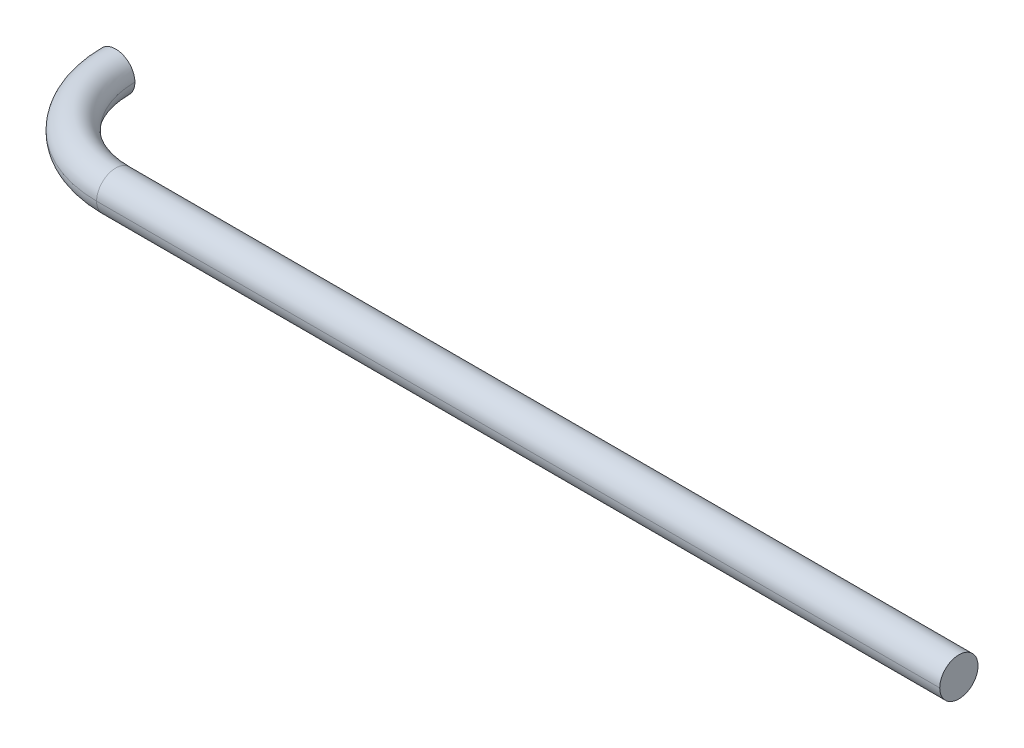
ISO-10303-21;
HEADER;
FILE_DESCRIPTION(('STEP AP214'),'2;1');
FILE_NAME('part.step','',(''),(''),'','','');
FILE_SCHEMA(('AUTOMOTIVE_DESIGN { 1 0 10303 214 1 1 1 1 }'));
ENDSEC;
DATA;
#1=APPLICATION_CONTEXT('core data for automotive mechanical design processes');
#2=APPLICATION_PROTOCOL_DEFINITION('international standard','automotive_design',2000,#1);
#3=PRODUCT_CONTEXT('',#1,'mechanical');
#4=PRODUCT('Part','Part','',(#3));
#5=PRODUCT_RELATED_PRODUCT_CATEGORY('part','',(#4));
#6=PRODUCT_DEFINITION_FORMATION('','',#4);
#7=PRODUCT_DEFINITION_CONTEXT('part definition',#1,'design');
#8=PRODUCT_DEFINITION('design','',#6,#7);
#9=PRODUCT_DEFINITION_SHAPE('','',#8);
#10=(LENGTH_UNIT() NAMED_UNIT(*) SI_UNIT(.MILLI.,.METRE.));
#11=(NAMED_UNIT(*) PLANE_ANGLE_UNIT() SI_UNIT($,.RADIAN.));
#12=(NAMED_UNIT(*) SI_UNIT($,.STERADIAN.) SOLID_ANGLE_UNIT());
#13=UNCERTAINTY_MEASURE_WITH_UNIT(LENGTH_MEASURE(1.E-05),#10,'distance_accuracy_value','');
#14=(GEOMETRIC_REPRESENTATION_CONTEXT(3) GLOBAL_UNCERTAINTY_ASSIGNED_CONTEXT((#13)) GLOBAL_UNIT_ASSIGNED_CONTEXT((#10,
#11,#12)) REPRESENTATION_CONTEXT('',''));
#15=CARTESIAN_POINT('',(0.,0.,0.));
#16=DIRECTION('',(0.,0.,1.));
#17=DIRECTION('',(1.,0.,0.));
#18=AXIS2_PLACEMENT_3D('',#15,#16,#17);
#19=CARTESIAN_POINT('',(3.4999999999986,0.,1.39727442019107E-12));
#20=DIRECTION('',(0.,1.,0.));
#21=DIRECTION('',(-1.,0.,-3.99221262911893E-13));
#22=AXIS2_PLACEMENT_3D('',#19,#20,#21);
#23=TOROIDAL_SURFACE('',#22,3.4999999999986,0.65);
#24=CARTESIAN_POINT('',(3.4999999999986,0.,1.39727442019107E-12));
#25=DIRECTION('',(0.,1.,0.));
#26=DIRECTION('',(0.,0.,1.));
#27=AXIS2_PLACEMENT_3D('',#24,#25,#26);
#28=CIRCLE('',#27,4.1499999999986);
#29=CARTESIAN_POINT('',(-0.65,0.,0.));
#30=VERTEX_POINT('',#29);
#31=CARTESIAN_POINT('',(3.49999999999748,0.,4.15));
#32=VERTEX_POINT('',#31);
#33=EDGE_CURVE('E63',#30,#32,#28,.T.);
#34=ORIENTED_EDGE('',*,*,#33,.F.);
#35=CARTESIAN_POINT('',(0.,0.,0.));
#36=DIRECTION('',(0.,0.,1.));
#37=DIRECTION('',(-1.,0.,0.));
#38=AXIS2_PLACEMENT_3D('',#35,#36,#37);
#39=CIRCLE('',#38,0.65);
#40=CARTESIAN_POINT('',(0.65,0.,0.));
#41=VERTEX_POINT('',#40);
#42=EDGE_CURVE('E28',#30,#41,#39,.T.);
#43=ORIENTED_EDGE('',*,*,#42,.T.);
#44=CARTESIAN_POINT('',(3.4999999999986,0.,1.39727442019107E-12));
#45=DIRECTION('',(0.,1.,0.));
#46=DIRECTION('',(0.,0.,1.));
#47=AXIS2_PLACEMENT_3D('',#44,#45,#46);
#48=CIRCLE('',#47,2.8499999999986);
#49=CARTESIAN_POINT('',(3.49999999999783,0.,2.85));
#50=VERTEX_POINT('',#49);
#51=EDGE_CURVE('E21',#41,#50,#48,.T.);
#52=ORIENTED_EDGE('',*,*,#51,.T.);
#53=CARTESIAN_POINT('',(3.49999999999765,0.,3.5));
#54=DIRECTION('',(1.,0.,2.71550944124062E-13));
#55=DIRECTION('',(-2.71550944124062E-13,0.,1.));
#56=AXIS2_PLACEMENT_3D('',#53,#54,#55);
#57=CIRCLE('',#56,0.65);
#58=EDGE_CURVE('E76',#32,#50,#57,.T.);
#59=ORIENTED_EDGE('',*,*,#58,.F.);
#60=EDGE_LOOP('',(#34,#43,#52,#59));
#61=FACE_BOUND('',#60,.T.);
#62=ADVANCED_FACE('F17',(#61),#23,.T.);
#63=CARTESIAN_POINT('',(3.49999999999765,0.,3.5));
#64=DIRECTION('',(1.,0.,0.));
#65=DIRECTION('',(0.,0.,1.));
#66=AXIS2_PLACEMENT_3D('',#63,#64,#65);
#67=CYLINDRICAL_SURFACE('',#66,0.65);
#68=DIRECTION('',(1.,0.,0.));
#69=VECTOR('',#68,1.);
#70=CARTESIAN_POINT('',(3.49999999999765,0.,2.85));
#71=LINE('',#70,#69);
#72=CARTESIAN_POINT('',(32.1389851691479,0.,2.85));
#73=VERTEX_POINT('',#72);
#74=EDGE_CURVE('E89',#50,#73,#71,.T.);
#75=ORIENTED_EDGE('',*,*,#74,.F.);
#76=CARTESIAN_POINT('',(3.49999999999765,0.,3.5));
#77=DIRECTION('',(1.,0.,2.71550944124062E-13));
#78=DIRECTION('',(-2.71550944124062E-13,0.,1.));
#79=AXIS2_PLACEMENT_3D('',#76,#77,#78);
#80=CIRCLE('',#79,0.65);
#81=EDGE_CURVE('E74',#50,#32,#80,.T.);
#82=ORIENTED_EDGE('',*,*,#81,.T.);
#83=DIRECTION('',(1.,0.,0.));
#84=VECTOR('',#83,1.);
#85=CARTESIAN_POINT('',(3.49999999999765,0.,4.15));
#86=LINE('',#85,#84);
#87=CARTESIAN_POINT('',(32.1389851691481,0.,4.15));
#88=VERTEX_POINT('',#87);
#89=EDGE_CURVE('E68',#32,#88,#86,.T.);
#90=ORIENTED_EDGE('',*,*,#89,.T.);
#91=CARTESIAN_POINT('',(32.138985169148,0.,3.5));
#92=DIRECTION('',(1.,0.,-1.28102656687518E-13));
#93=DIRECTION('',(1.28102656687518E-13,0.,1.));
#94=AXIS2_PLACEMENT_3D('',#91,#92,#93);
#95=CIRCLE('',#94,0.65);
#96=EDGE_CURVE('E11',#73,#88,#95,.T.);
#97=ORIENTED_EDGE('',*,*,#96,.F.);
#98=EDGE_LOOP('',(#75,#82,#90,#97));
#99=FACE_BOUND('',#98,.T.);
#100=ADVANCED_FACE('F103',(#99),#67,.T.);
#101=CARTESIAN_POINT('',(32.138985169148,0.,3.5));
#102=DIRECTION('',(1.,0.,-1.27491950812021E-13));
#103=DIRECTION('',(-1.27491950812021E-13,0.,-1.));
#104=AXIS2_PLACEMENT_3D('',#101,#102,#103);
#105=PLANE('',#104);
#106=CARTESIAN_POINT('',(32.138985169148,0.,3.5));
#107=DIRECTION('',(1.,0.,-1.28102656687518E-13));
#108=DIRECTION('',(1.28102656687518E-13,0.,1.));
#109=AXIS2_PLACEMENT_3D('',#106,#107,#108);
#110=CIRCLE('',#109,0.65);
#111=EDGE_CURVE('E87',#88,#73,#110,.T.);
#112=ORIENTED_EDGE('',*,*,#111,.T.);
#113=ORIENTED_EDGE('',*,*,#96,.T.);
#114=EDGE_LOOP('',(#112,#113));
#115=FACE_BOUND('',#114,.T.);
#116=ADVANCED_FACE('F191',(#115),#105,.T.);
#117=CARTESIAN_POINT('',(0.,0.,0.));
#118=DIRECTION('',(0.,0.,1.));
#119=DIRECTION('',(1.,0.,0.));
#120=AXIS2_PLACEMENT_3D('',#117,#118,#119);
#121=PLANE('',#120);
#122=CARTESIAN_POINT('',(0.,0.,0.));
#123=DIRECTION('',(0.,0.,1.));
#124=DIRECTION('',(-1.,0.,0.));
#125=AXIS2_PLACEMENT_3D('',#122,#123,#124);
#126=CIRCLE('',#125,0.65);
#127=EDGE_CURVE('E72',#41,#30,#126,.T.);
#128=ORIENTED_EDGE('',*,*,#127,.F.);
#129=ORIENTED_EDGE('',*,*,#42,.F.);
#130=EDGE_LOOP('',(#128,#129));
#131=FACE_BOUND('',#130,.T.);
#132=ADVANCED_FACE('F77',(#131),#121,.F.);
#133=CARTESIAN_POINT('',(3.49999999999765,0.,3.5));
#134=DIRECTION('',(1.,0.,0.));
#135=DIRECTION('',(0.,0.,1.));
#136=AXIS2_PLACEMENT_3D('',#133,#134,#135);
#137=CYLINDRICAL_SURFACE('',#136,0.65);
#138=ORIENTED_EDGE('',*,*,#58,.T.);
#139=ORIENTED_EDGE('',*,*,#74,.T.);
#140=ORIENTED_EDGE('',*,*,#111,.F.);
#141=ORIENTED_EDGE('',*,*,#89,.F.);
#142=EDGE_LOOP('',(#138,#139,#140,#141));
#143=FACE_BOUND('',#142,.T.);
#144=ADVANCED_FACE('F19',(#143),#137,.T.);
#145=CARTESIAN_POINT('',(3.4999999999986,0.,1.39727442019107E-12));
#146=DIRECTION('',(0.,1.,0.));
#147=DIRECTION('',(-1.,0.,-3.99221262911893E-13));
#148=AXIS2_PLACEMENT_3D('',#145,#146,#147);
#149=TOROIDAL_SURFACE('',#148,3.4999999999986,0.65);
#150=ORIENTED_EDGE('',*,*,#127,.T.);
#151=ORIENTED_EDGE('',*,*,#33,.T.);
#152=ORIENTED_EDGE('',*,*,#81,.F.);
#153=ORIENTED_EDGE('',*,*,#51,.F.);
#154=EDGE_LOOP('',(#150,#151,#152,#153));
#155=FACE_BOUND('',#154,.T.);
#156=ADVANCED_FACE('F71',(#155),#149,.T.);
#157=CLOSED_SHELL('',(#62,#100,#116,#132,#144,#156));
#158=MANIFOLD_SOLID_BREP('B1',#157);
#159=ADVANCED_BREP_SHAPE_REPRESENTATION('',(#18,#158),#14);
#160=SHAPE_DEFINITION_REPRESENTATION(#9,#159);
ENDSEC;
END-ISO-10303-21;
